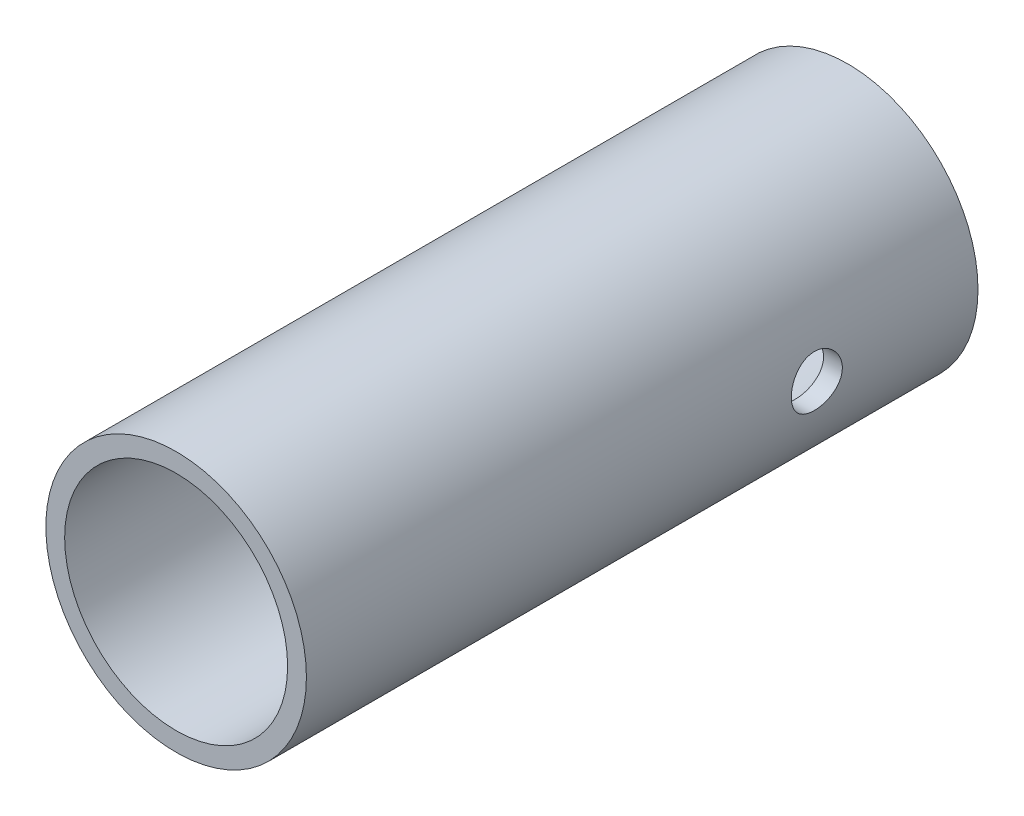
ISO-10303-21;
HEADER;
FILE_DESCRIPTION(('STEP AP214'),'2;1');
FILE_NAME('part.step','',(''),(''),'','','');
FILE_SCHEMA(('AUTOMOTIVE_DESIGN { 1 0 10303 214 1 1 1 1 }'));
ENDSEC;
DATA;
#1=APPLICATION_CONTEXT('core data for automotive mechanical design processes');
#2=APPLICATION_PROTOCOL_DEFINITION('international standard','automotive_design',2000,#1);
#3=PRODUCT_CONTEXT('',#1,'mechanical');
#4=PRODUCT('Part','Part','',(#3));
#5=PRODUCT_RELATED_PRODUCT_CATEGORY('part','',(#4));
#6=PRODUCT_DEFINITION_FORMATION('','',#4);
#7=PRODUCT_DEFINITION_CONTEXT('part definition',#1,'design');
#8=PRODUCT_DEFINITION('design','',#6,#7);
#9=PRODUCT_DEFINITION_SHAPE('','',#8);
#10=(LENGTH_UNIT() NAMED_UNIT(*) SI_UNIT(.MILLI.,.METRE.));
#11=(NAMED_UNIT(*) PLANE_ANGLE_UNIT() SI_UNIT($,.RADIAN.));
#12=(NAMED_UNIT(*) SI_UNIT($,.STERADIAN.) SOLID_ANGLE_UNIT());
#13=UNCERTAINTY_MEASURE_WITH_UNIT(LENGTH_MEASURE(1.E-05),#10,'distance_accuracy_value','');
#14=(GEOMETRIC_REPRESENTATION_CONTEXT(3) GLOBAL_UNCERTAINTY_ASSIGNED_CONTEXT((#13)) GLOBAL_UNIT_ASSIGNED_CONTEXT((#10,
#11,#12)) REPRESENTATION_CONTEXT('',''));
#15=CARTESIAN_POINT('',(0.,0.,0.));
#16=DIRECTION('',(0.,0.,1.));
#17=DIRECTION('',(1.,0.,0.));
#18=AXIS2_PLACEMENT_3D('',#15,#16,#17);
#19=CARTESIAN_POINT('',(0.,0.,25.));
#20=DIRECTION('',(0.,0.,-1.));
#21=DIRECTION('',(-1.,0.,0.));
#22=AXIS2_PLACEMENT_3D('',#19,#20,#21);
#23=CYLINDRICAL_SURFACE('',#22,4.85);
#24=CARTESIAN_POINT('',(-4.85,0.,5.05));
#25=CARTESIAN_POINT('',(-4.84999903083924,0.0528207427408081,5.05000196937121));
#26=CARTESIAN_POINT('',(-4.84912822964573,0.105666623027377,5.05442019718693));
#27=CARTESIAN_POINT('',(-4.84573840466213,0.209866186059338,5.07196323258526));
#28=CARTESIAN_POINT('',(-4.84321804398227,0.261218623152241,5.08509510228102));
#29=CARTESIAN_POINT('',(-4.83681070289238,0.360909546946135,5.11964543362747));
#30=CARTESIAN_POINT('',(-4.83292500670396,0.409250815794708,5.14105611020514));
#31=CARTESIAN_POINT('',(-4.824210045949,0.501651250568184,5.19153349478004));
#32=CARTESIAN_POINT('',(-4.81938084434004,0.545710701913675,5.22059969198999));
#33=CARTESIAN_POINT('',(-4.80924060522278,0.62887402327351,5.28596430496871));
#34=CARTESIAN_POINT('',(-4.80392460597073,0.667914119554328,5.32234309836538));
#35=CARTESIAN_POINT('',(-4.79344625935296,0.739378485234693,5.40112741723243));
#36=CARTESIAN_POINT('',(-4.78828392368136,0.771802252211187,5.44353339997394));
#37=CARTESIAN_POINT('',(-4.77864902903195,0.829382932495623,5.53362437869465));
#38=CARTESIAN_POINT('',(-4.77418285872138,0.854474201434232,5.58135207416335));
#39=CARTESIAN_POINT('',(-4.76651625404854,0.896257200966038,5.68044771127167));
#40=CARTESIAN_POINT('',(-4.76331570003591,0.912949725610517,5.7318153082562));
#41=CARTESIAN_POINT('',(-4.75859282118519,0.93725515466383,5.83604772059499));
#42=CARTESIAN_POINT('',(-4.75704987461782,0.944979726337389,5.88888554354924));
#43=CARTESIAN_POINT('',(-4.7557548043355,0.951476745499511,5.99512803252176));
#44=CARTESIAN_POINT('',(-4.7560025051227,0.950250070282137,6.04853264247808));
#45=CARTESIAN_POINT('',(-4.75824199309927,0.938969789260116,6.1535784548674));
#46=CARTESIAN_POINT('',(-4.76020855480977,0.929043845569496,6.20523398395491));
#47=CARTESIAN_POINT('',(-4.76562449613615,0.900848143139989,6.30613213703227));
#48=CARTESIAN_POINT('',(-4.76907394395024,0.882578000647468,6.35537464993101));
#49=CARTESIAN_POINT('',(-4.7770929768734,0.838089633425469,6.45041875544915));
#50=CARTESIAN_POINT('',(-4.78166970108501,0.81182048975589,6.49619588660097));
#51=CARTESIAN_POINT('',(-4.79142297617805,0.752115760040911,6.58274035188247));
#52=CARTESIAN_POINT('',(-4.79659959326066,0.71867938270875,6.62350713206999));
#53=CARTESIAN_POINT('',(-4.80707887536163,0.644904192617051,6.69961064081078));
#54=CARTESIAN_POINT('',(-4.81238217506596,0.604456341824736,6.7348416649123));
#55=CARTESIAN_POINT('',(-4.82243547139897,0.518169562088268,6.79803506850899));
#56=CARTESIAN_POINT('',(-4.82718546147511,0.47233056931268,6.82599736192939));
#57=CARTESIAN_POINT('',(-4.83560789480132,0.376447699965948,6.87387776710658));
#58=CARTESIAN_POINT('',(-4.83927876649163,0.32639782593597,6.89378416248669));
#59=CARTESIAN_POINT('',(-4.84511735851095,0.223576441811,6.92487696730025));
#60=CARTESIAN_POINT('',(-4.84728525336022,0.170805248470621,6.93606438916836));
#61=CARTESIAN_POINT('',(-4.84984943594185,0.0649479184607016,6.94925287420164));
#62=CARTESIAN_POINT('',(-4.85027362974496,0.0118804663229498,6.9513986533079));
#63=CARTESIAN_POINT('',(-4.8493799832304,-0.0938547813531432,6.94683215765911));
#64=CARTESIAN_POINT('',(-4.84806223666847,-0.146522598247449,6.94012035964191));
#65=CARTESIAN_POINT('',(-4.84385020682106,-0.249499306347915,6.91814949380826));
#66=CARTESIAN_POINT('',(-4.8409695617201,-0.299824573103678,6.90296433416511));
#67=CARTESIAN_POINT('',(-4.83395349984155,-0.39721470388934,6.86455829550828));
#68=CARTESIAN_POINT('',(-4.8298179919552,-0.444279330877012,6.84133683300505));
#69=CARTESIAN_POINT('',(-4.82068138542306,-0.53442496962058,6.78720185999841));
#70=CARTESIAN_POINT('',(-4.81567064519529,-0.577452398623696,6.75620078469319));
#71=CARTESIAN_POINT('',(-4.80536278406939,-0.65774627139636,6.68750425640485));
#72=CARTESIAN_POINT('',(-4.80006563384635,-0.695012123736601,6.64980811702167));
#73=CARTESIAN_POINT('',(-4.78968840721326,-0.763280633999259,6.56813392274997));
#74=CARTESIAN_POINT('',(-4.78461261748262,-0.794184137896305,6.52407235092258));
#75=CARTESIAN_POINT('',(-4.77534206393745,-0.848151543846252,6.43129852392472));
#76=CARTESIAN_POINT('',(-4.77114726566023,-0.871215752579222,6.38258645078145));
#77=CARTESIAN_POINT('',(-4.76414793650798,-0.908712726698105,6.28213506106267));
#78=CARTESIAN_POINT('',(-4.76133637049498,-0.923189248283483,6.23041259144157));
#79=CARTESIAN_POINT('',(-4.75740653422465,-0.943233405393607,6.12520866500382));
#80=CARTESIAN_POINT('',(-4.75628805327706,-0.94880214942153,6.07172742789749));
#81=CARTESIAN_POINT('',(-4.75588238506367,-0.950832965210094,5.96551882540325));
#82=CARTESIAN_POINT('',(-4.75656370925973,-0.947451621392281,5.91279451158233));
#83=CARTESIAN_POINT('',(-4.75961070760761,-0.932022899461825,5.80868165557292));
#84=CARTESIAN_POINT('',(-4.76197636943637,-0.919975584751645,5.7572931036145));
#85=CARTESIAN_POINT('',(-4.76811168697962,-0.887625490948483,5.6574049549024));
#86=CARTESIAN_POINT('',(-4.77187820382273,-0.867341159134214,5.60889917847277));
#87=CARTESIAN_POINT('',(-4.78039277123525,-0.819110506924346,5.51595467479358));
#88=CARTESIAN_POINT('',(-4.78514089978693,-0.791163577730771,5.47151627107358));
#89=CARTESIAN_POINT('',(-4.79518051509526,-0.727863006470876,5.38718667606625));
#90=CARTESIAN_POINT('',(-4.80047960155842,-0.692395985004618,5.34738148060475));
#91=CARTESIAN_POINT('',(-4.81096874557515,-0.615296895215185,5.27423565128147));
#92=CARTESIAN_POINT('',(-4.81615877780379,-0.573663412574319,5.24089650451166));
#93=CARTESIAN_POINT('',(-4.82590592024148,-0.484915122636675,5.18131650918356));
#94=CARTESIAN_POINT('',(-4.83045620792622,-0.437749827691263,5.1551497066266));
#95=CARTESIAN_POINT('',(-4.83834421189105,-0.339616533796544,5.11115437202579));
#96=CARTESIAN_POINT('',(-4.84168303604696,-0.288652060858103,5.09331821734623));
#97=CARTESIAN_POINT('',(-4.84611244532914,-0.197967463394652,5.07000131439655));
#98=CARTESIAN_POINT('',(-4.84756184789868,-0.158768405255598,5.06251400598928));
#99=CARTESIAN_POINT('',(-4.84950597683881,-0.079717658245463,5.05251267920694));
#100=CARTESIAN_POINT('',(-4.85000073146552,-0.0398659887258778,5.04999851363449));
#101=CARTESIAN_POINT('',(-4.85,0.,5.05));
#102=B_SPLINE_CURVE_WITH_KNOTS('',3,(#24,#25,#26,#27,#28,#29,#30,#31,#32,#33,#34,#35,#36,#37,
#38,#39,#40,#41,#42,#43,#44,#45,#46,#47,#48,#49,#50,#51,#52,#53,#54,#55,#56,#57,#58,#59,#60,#61,
#62,#63,#64,#65,#66,#67,#68,#69,#70,#71,#72,#73,#74,#75,#76,#77,#78,#79,#80,#81,#82,#83,#84,#85,
#86,#87,#88,#89,#90,#91,#92,#93,#94,#95,#96,#97,#98,#99,#100,#101),.UNSPECIFIED.,.T.,.F.,(4,2,2,
2,2,2,2,2,2,2,2,2,2,2,2,2,2,2,2,2,2,2,2,2,2,2,2,2,2,2,2,2,2,2,2,2,2,2,4),(0.,0.158316403222294,
0.316761273530738,0.475057509286654,0.63334318596582,0.793474514008009,0.953617997393803,
1.11515408669274,1.27667490084478,1.43616215402555,1.59563377638494,1.75280360996376,
1.90998067258526,2.06817996339259,2.22639672893904,2.38734054409755,2.54828626503205,
2.70946522895598,2.87062547422115,3.02919623491599,3.18775846126779,3.34495878681936,
3.50217052856555,3.66123807288888,3.82032193476559,3.98172339534944,4.14311854104033,
4.30368411706997,4.46422971041591,4.6219851550573,4.77973944553119,4.93714236763767,
5.09455779912675,5.25454092463038,5.41456080028072,5.57617529133934,5.73764161222316,
5.85713305508655,5.97662096113421),.UNSPECIFIED.);
#103=CARTESIAN_POINT('',(-4.85,0.,5.05));
#104=VERTEX_POINT('',#103);
#105=EDGE_CURVE('E77',#104,#104,#102,.T.);
#106=ORIENTED_EDGE('',*,*,#105,.T.);
#107=EDGE_LOOP('',(#106));
#108=FACE_BOUND('',#107,.T.);
#109=CARTESIAN_POINT('',(4.85,0.,5.05));
#110=CARTESIAN_POINT('',(4.84999903083924,-0.0528207427408081,5.05000196937121));
#111=CARTESIAN_POINT('',(4.84912822964573,-0.105666623027377,5.05442019718693));
#112=CARTESIAN_POINT('',(4.84573840466213,-0.209866186059338,5.07196323258526));
#113=CARTESIAN_POINT('',(4.84321804398227,-0.261218623152241,5.08509510228102));
#114=CARTESIAN_POINT('',(4.83681070289238,-0.360909546946135,5.11964543362747));
#115=CARTESIAN_POINT('',(4.83292500670396,-0.409250815794708,5.14105611020514));
#116=CARTESIAN_POINT('',(4.824210045949,-0.501651250568184,5.19153349478004));
#117=CARTESIAN_POINT('',(4.81938084434004,-0.545710701913675,5.22059969198999));
#118=CARTESIAN_POINT('',(4.80924060522278,-0.62887402327351,5.28596430496871));
#119=CARTESIAN_POINT('',(4.80392460597073,-0.667914119554328,5.32234309836538));
#120=CARTESIAN_POINT('',(4.79344625935296,-0.739378485234693,5.40112741723243));
#121=CARTESIAN_POINT('',(4.78828392368136,-0.771802252211187,5.44353339997394));
#122=CARTESIAN_POINT('',(4.77864902903195,-0.829382932495623,5.53362437869465));
#123=CARTESIAN_POINT('',(4.77418285872138,-0.854474201434232,5.58135207416335));
#124=CARTESIAN_POINT('',(4.76651625404854,-0.896257200966038,5.68044771127167));
#125=CARTESIAN_POINT('',(4.76331570003591,-0.912949725610517,5.7318153082562));
#126=CARTESIAN_POINT('',(4.75859282118519,-0.93725515466383,5.83604772059499));
#127=CARTESIAN_POINT('',(4.75704987461782,-0.944979726337389,5.88888554354924));
#128=CARTESIAN_POINT('',(4.7557548043355,-0.951476745499511,5.99512803252176));
#129=CARTESIAN_POINT('',(4.7560025051227,-0.950250070282137,6.04853264247808));
#130=CARTESIAN_POINT('',(4.75824199309927,-0.938969789260116,6.1535784548674));
#131=CARTESIAN_POINT('',(4.76020855480977,-0.929043845569496,6.20523398395491));
#132=CARTESIAN_POINT('',(4.76562449613615,-0.900848143139989,6.30613213703227));
#133=CARTESIAN_POINT('',(4.76907394395024,-0.882578000647468,6.35537464993101));
#134=CARTESIAN_POINT('',(4.7770929768734,-0.838089633425469,6.45041875544915));
#135=CARTESIAN_POINT('',(4.78166970108501,-0.81182048975589,6.49619588660097));
#136=CARTESIAN_POINT('',(4.79142297617805,-0.752115760040911,6.58274035188247));
#137=CARTESIAN_POINT('',(4.79659959326066,-0.71867938270875,6.62350713206999));
#138=CARTESIAN_POINT('',(4.80707887536163,-0.644904192617051,6.69961064081078));
#139=CARTESIAN_POINT('',(4.81238217506596,-0.604456341824736,6.7348416649123));
#140=CARTESIAN_POINT('',(4.82243547139897,-0.518169562088268,6.79803506850899));
#141=CARTESIAN_POINT('',(4.82718546147511,-0.47233056931268,6.82599736192939));
#142=CARTESIAN_POINT('',(4.83560789480132,-0.376447699965948,6.87387776710658));
#143=CARTESIAN_POINT('',(4.83927876649163,-0.32639782593597,6.89378416248669));
#144=CARTESIAN_POINT('',(4.84511735851095,-0.223576441811,6.92487696730025));
#145=CARTESIAN_POINT('',(4.84728525336022,-0.170805248470621,6.93606438916836));
#146=CARTESIAN_POINT('',(4.84984943594185,-0.0649479184607016,6.94925287420164));
#147=CARTESIAN_POINT('',(4.85027362974496,-0.0118804663229498,6.9513986533079));
#148=CARTESIAN_POINT('',(4.8493799832304,0.0938547813531432,6.94683215765911));
#149=CARTESIAN_POINT('',(4.84806223666847,0.146522598247449,6.94012035964191));
#150=CARTESIAN_POINT('',(4.84385020682106,0.249499306347915,6.91814949380826));
#151=CARTESIAN_POINT('',(4.8409695617201,0.299824573103678,6.90296433416511));
#152=CARTESIAN_POINT('',(4.83395349984155,0.39721470388934,6.86455829550828));
#153=CARTESIAN_POINT('',(4.8298179919552,0.444279330877012,6.84133683300505));
#154=CARTESIAN_POINT('',(4.82068138542306,0.53442496962058,6.78720185999841));
#155=CARTESIAN_POINT('',(4.81567064519529,0.577452398623696,6.75620078469319));
#156=CARTESIAN_POINT('',(4.80536278406939,0.65774627139636,6.68750425640485));
#157=CARTESIAN_POINT('',(4.80006563384635,0.695012123736601,6.64980811702167));
#158=CARTESIAN_POINT('',(4.78968840721326,0.763280633999259,6.56813392274997));
#159=CARTESIAN_POINT('',(4.78461261748262,0.794184137896305,6.52407235092258));
#160=CARTESIAN_POINT('',(4.77534206393745,0.848151543846252,6.43129852392472));
#161=CARTESIAN_POINT('',(4.77114726566023,0.871215752579222,6.38258645078145));
#162=CARTESIAN_POINT('',(4.76414793650798,0.908712726698105,6.28213506106267));
#163=CARTESIAN_POINT('',(4.76133637049498,0.923189248283483,6.23041259144157));
#164=CARTESIAN_POINT('',(4.75740653422465,0.943233405393607,6.12520866500382));
#165=CARTESIAN_POINT('',(4.75628805327706,0.94880214942153,6.07172742789749));
#166=CARTESIAN_POINT('',(4.75588238506367,0.950832965210094,5.96551882540325));
#167=CARTESIAN_POINT('',(4.75656370925973,0.947451621392281,5.91279451158233));
#168=CARTESIAN_POINT('',(4.75961070760761,0.932022899461825,5.80868165557292));
#169=CARTESIAN_POINT('',(4.76197636943637,0.919975584751645,5.7572931036145));
#170=CARTESIAN_POINT('',(4.76811168697962,0.887625490948483,5.6574049549024));
#171=CARTESIAN_POINT('',(4.77187820382273,0.867341159134214,5.60889917847277));
#172=CARTESIAN_POINT('',(4.78039277123525,0.819110506924346,5.51595467479358));
#173=CARTESIAN_POINT('',(4.78514089978693,0.791163577730771,5.47151627107358));
#174=CARTESIAN_POINT('',(4.79518051509526,0.727863006470876,5.38718667606625));
#175=CARTESIAN_POINT('',(4.80047960155842,0.692395985004618,5.34738148060475));
#176=CARTESIAN_POINT('',(4.81096874557515,0.615296895215185,5.27423565128147));
#177=CARTESIAN_POINT('',(4.81615877780379,0.573663412574319,5.24089650451166));
#178=CARTESIAN_POINT('',(4.82590592024148,0.484915122636675,5.18131650918356));
#179=CARTESIAN_POINT('',(4.83045620792622,0.437749827691263,5.1551497066266));
#180=CARTESIAN_POINT('',(4.83834421189105,0.339616533796544,5.11115437202579));
#181=CARTESIAN_POINT('',(4.84168303604696,0.288652060858103,5.09331821734623));
#182=CARTESIAN_POINT('',(4.84611244532914,0.197967463394652,5.07000131439655));
#183=CARTESIAN_POINT('',(4.84756184789868,0.158768405255598,5.06251400598928));
#184=CARTESIAN_POINT('',(4.84950597683881,0.079717658245463,5.05251267920694));
#185=CARTESIAN_POINT('',(4.85000073146552,0.0398659887258778,5.04999851363449));
#186=CARTESIAN_POINT('',(4.85,0.,5.05));
#187=B_SPLINE_CURVE_WITH_KNOTS('',3,(#109,#110,#111,#112,#113,#114,#115,#116,#117,#118,#119,
#120,#121,#122,#123,#124,#125,#126,#127,#128,#129,#130,#131,#132,#133,#134,#135,#136,#137,#138,
#139,#140,#141,#142,#143,#144,#145,#146,#147,#148,#149,#150,#151,#152,#153,#154,#155,#156,#157,
#158,#159,#160,#161,#162,#163,#164,#165,#166,#167,#168,#169,#170,#171,#172,#173,#174,#175,#176,
#177,#178,#179,#180,#181,#182,#183,#184,#185,#186),.UNSPECIFIED.,.T.,.F.,(4,2,2,2,2,2,2,2,2,2,2,
2,2,2,2,2,2,2,2,2,2,2,2,2,2,2,2,2,2,2,2,2,2,2,2,2,2,2,4),(0.,0.158316403222294,
0.316761273530738,0.475057509286654,0.63334318596582,0.793474514008009,0.953617997393803,
1.11515408669274,1.27667490084478,1.43616215402555,1.59563377638494,1.75280360996376,
1.90998067258526,2.06817996339259,2.22639672893904,2.38734054409755,2.54828626503205,
2.70946522895598,2.87062547422115,3.02919623491599,3.18775846126779,3.34495878681936,
3.50217052856555,3.66123807288888,3.82032193476559,3.98172339534944,4.14311854104033,
4.30368411706997,4.46422971041591,4.6219851550573,4.77973944553119,4.93714236763767,
5.09455779912675,5.25454092463038,5.41456080028072,5.57617529133934,5.73764161222316,
5.85713305508655,5.97662096113421),.UNSPECIFIED.);
#188=CARTESIAN_POINT('',(4.85,0.,5.05));
#189=VERTEX_POINT('',#188);
#190=EDGE_CURVE('E72',#189,#189,#187,.T.);
#191=ORIENTED_EDGE('',*,*,#190,.T.);
#192=EDGE_LOOP('',(#191));
#193=FACE_BOUND('',#192,.T.);
#194=CARTESIAN_POINT('',(0.,0.,25.));
#195=DIRECTION('',(0.,0.,1.));
#196=DIRECTION('',(1.,0.,0.));
#197=AXIS2_PLACEMENT_3D('',#194,#195,#196);
#198=CIRCLE('',#197,4.85);
#199=CARTESIAN_POINT('',(4.85,0.,25.));
#200=VERTEX_POINT('',#199);
#201=EDGE_CURVE('E10',#200,#200,#198,.T.);
#202=ORIENTED_EDGE('',*,*,#201,.F.);
#203=EDGE_LOOP('',(#202));
#204=FACE_BOUND('',#203,.T.);
#205=CARTESIAN_POINT('',(0.,0.,0.));
#206=DIRECTION('',(0.,0.,1.));
#207=DIRECTION('',(1.,0.,0.));
#208=AXIS2_PLACEMENT_3D('',#205,#206,#207);
#209=CIRCLE('',#208,4.85);
#210=CARTESIAN_POINT('',(4.85,0.,0.));
#211=VERTEX_POINT('',#210);
#212=EDGE_CURVE('E44',#211,#211,#209,.T.);
#213=ORIENTED_EDGE('',*,*,#212,.T.);
#214=EDGE_LOOP('',(#213));
#215=FACE_BOUND('',#214,.T.);
#216=ADVANCED_FACE('F31',(#108,#193,#204,#215),#23,.T.);
#217=CARTESIAN_POINT('',(0.,0.,25.));
#218=DIRECTION('',(0.,0.,1.));
#219=DIRECTION('',(1.,0.,0.));
#220=AXIS2_PLACEMENT_3D('',#217,#218,#219);
#221=PLANE('',#220);
#222=CARTESIAN_POINT('',(0.,0.,25.));
#223=DIRECTION('',(0.,0.,1.));
#224=DIRECTION('',(1.,0.,0.));
#225=AXIS2_PLACEMENT_3D('',#222,#223,#224);
#226=CIRCLE('',#225,4.15);
#227=CARTESIAN_POINT('',(4.15,0.,25.));
#228=VERTEX_POINT('',#227);
#229=EDGE_CURVE('E52',#228,#228,#226,.T.);
#230=ORIENTED_EDGE('',*,*,#229,.F.);
#231=EDGE_LOOP('',(#230));
#232=FACE_BOUND('',#231,.T.);
#233=ORIENTED_EDGE('',*,*,#201,.T.);
#234=EDGE_LOOP('',(#233));
#235=FACE_BOUND('',#234,.T.);
#236=ADVANCED_FACE('F89',(#232,#235),#221,.T.);
#237=CARTESIAN_POINT('',(0.,0.,0.));
#238=DIRECTION('',(0.,0.,1.));
#239=DIRECTION('',(1.,0.,0.));
#240=AXIS2_PLACEMENT_3D('',#237,#238,#239);
#241=PLANE('',#240);
#242=CARTESIAN_POINT('',(0.,0.,0.));
#243=DIRECTION('',(0.,0.,1.));
#244=DIRECTION('',(1.,0.,0.));
#245=AXIS2_PLACEMENT_3D('',#242,#243,#244);
#246=CIRCLE('',#245,4.15);
#247=CARTESIAN_POINT('',(4.15,0.,0.));
#248=VERTEX_POINT('',#247);
#249=EDGE_CURVE('E49',#248,#248,#246,.T.);
#250=ORIENTED_EDGE('',*,*,#249,.T.);
#251=EDGE_LOOP('',(#250));
#252=FACE_BOUND('',#251,.T.);
#253=ORIENTED_EDGE('',*,*,#212,.F.);
#254=EDGE_LOOP('',(#253));
#255=FACE_BOUND('',#254,.T.);
#256=ADVANCED_FACE('F91',(#252,#255),#241,.F.);
#257=CARTESIAN_POINT('',(0.,0.,0.));
#258=DIRECTION('',(0.,0.,1.));
#259=DIRECTION('',(1.,0.,0.));
#260=AXIS2_PLACEMENT_3D('',#257,#258,#259);
#261=CYLINDRICAL_SURFACE('',#260,4.15);
#262=CARTESIAN_POINT('',(4.15,0.,5.05));
#263=CARTESIAN_POINT('',(4.1499990431047,0.0526266300269672,5.05000170628251));
#264=CARTESIAN_POINT('',(4.14898884199091,0.105273363842752,5.05438774389128));
#265=CARTESIAN_POINT('',(4.14505661336488,0.20906720348093,5.07179529282467));
#266=CARTESIAN_POINT('',(4.14213330810943,0.2602132831606,5.08482257562995));
#267=CARTESIAN_POINT('',(4.13469980708857,0.35949114911916,5.11907987121897));
#268=CARTESIAN_POINT('',(4.13019134784451,0.407626166291621,5.14030091030706));
#269=CARTESIAN_POINT('',(4.12007210542072,0.499651603626272,5.1903138590752));
#270=CARTESIAN_POINT('',(4.11446132980809,0.543542052923207,5.21910571678405));
#271=CARTESIAN_POINT('',(4.10264074394695,0.626600677262044,5.28397522813313));
#272=CARTESIAN_POINT('',(4.09642292334231,0.665684059677564,5.32015999853546));
#273=CARTESIAN_POINT('',(4.08414444724267,0.737283330159248,5.39855841526884));
#274=CARTESIAN_POINT('',(4.07808380690376,0.769798586931493,5.44077264045456));
#275=CARTESIAN_POINT('',(4.06672640048456,0.827720392063375,5.53066840792679));
#276=CARTESIAN_POINT('',(4.06143987082393,0.853035243848821,5.57841044172676));
#277=CARTESIAN_POINT('',(4.05234483226091,0.895248999553901,5.67761227062808));
#278=CARTESIAN_POINT('',(4.04853612840857,0.912149013614794,5.72907157429627));
#279=CARTESIAN_POINT('',(4.04290980982978,0.936770298026267,5.83332332784539));
#280=CARTESIAN_POINT('',(4.04105950764903,0.944642444004567,5.88607834237212));
#281=CARTESIAN_POINT('',(4.03946142587473,0.951453928799262,5.99219021037871));
#282=CARTESIAN_POINT('',(4.03971336218309,0.950394474638595,6.04554698156347));
#283=CARTESIAN_POINT('',(4.042261763179,0.939493923040313,6.15021550154493));
#284=CARTESIAN_POINT('',(4.0445170984402,0.929829475287267,6.20154680184182));
#285=CARTESIAN_POINT('',(4.05075299012675,0.90227374185752,6.30183953268712));
#286=CARTESIAN_POINT('',(4.05473365156938,0.884381955394552,6.35080081877564));
#287=CARTESIAN_POINT('',(4.06401133125278,0.840720909829477,6.44545310532887));
#288=CARTESIAN_POINT('',(4.06931942547403,0.814884926115809,6.49111219620395));
#289=CARTESIAN_POINT('',(4.08064726223482,0.75611570711857,6.5775116902168));
#290=CARTESIAN_POINT('',(4.08666711041911,0.723181417643854,6.61825136135273));
#291=CARTESIAN_POINT('',(4.09891562370143,0.65022162251444,6.69467118224112));
#292=CARTESIAN_POINT('',(4.10514585222468,0.610046248401971,6.7302081518458));
#293=CARTESIAN_POINT('',(4.11698331327975,0.5242341341636,6.7940647940953));
#294=CARTESIAN_POINT('',(4.12259053233766,0.478597275965907,6.82238431066459));
#295=CARTESIAN_POINT('',(4.13257121176282,0.38297371843454,6.87104281693724));
#296=CARTESIAN_POINT('',(4.13694154801903,0.332976414477383,6.89136164827125));
#297=CARTESIAN_POINT('',(4.14393302073084,0.230154456825024,6.92326878852111));
#298=CARTESIAN_POINT('',(4.14655443638968,0.177330255879854,6.934858491021));
#299=CARTESIAN_POINT('',(4.14971247002223,0.0715808809657144,6.94876689554449));
#300=CARTESIAN_POINT('',(4.15029301873114,0.018682681532132,6.95128098727637));
#301=CARTESIAN_POINT('',(4.14942764097732,-0.0867779888507933,6.94749836514447));
#302=CARTESIAN_POINT('',(4.1479818658156,-0.139340484571995,6.94120230911451));
#303=CARTESIAN_POINT('',(4.14325415116441,-0.241980440388931,6.92013987981311));
#304=CARTESIAN_POINT('',(4.13999471818365,-0.292080323725262,6.90547727514443));
#305=CARTESIAN_POINT('',(4.13200512461609,-0.389108784790683,6.86821418578186));
#306=CARTESIAN_POINT('',(4.12727483082904,-0.436037074833515,6.84561298214934));
#307=CARTESIAN_POINT('',(4.11676071580013,-0.526188707548941,6.79271610120167));
#308=CARTESIAN_POINT('',(4.11096179380553,-0.569343874353455,6.7623073024571));
#309=CARTESIAN_POINT('',(4.09898212447264,-0.650008765436947,6.6948059875968));
#310=CARTESIAN_POINT('',(4.09280132256033,-0.687517680172095,6.65771251472318));
#311=CARTESIAN_POINT('',(4.08060072391238,-0.756608213130399,6.57699454483362));
#312=CARTESIAN_POINT('',(4.0745867492346,-0.788053930731272,6.53325267332252));
#313=CARTESIAN_POINT('',(4.06354313739658,-0.843154808244212,6.44099475414859));
#314=CARTESIAN_POINT('',(4.0585134565973,-0.866810313570048,6.39247891828466));
#315=CARTESIAN_POINT('',(4.05005866970136,-0.905492723390054,6.29231451858438));
#316=CARTESIAN_POINT('',(4.04662429775863,-0.920569572361289,6.240686064205));
#317=CARTESIAN_POINT('',(4.04173432178061,-0.941809242961782,6.13553880025276));
#318=CARTESIAN_POINT('',(4.04027836615735,-0.947973648450039,6.08202032829324));
#319=CARTESIAN_POINT('',(4.03953370833972,-0.951141111445644,5.97598618206644));
#320=CARTESIAN_POINT('',(4.04019391412747,-0.948360137936124,5.92347720508126));
#321=CARTESIAN_POINT('',(4.04349083585647,-0.934202177423752,5.81969770114546));
#322=CARTESIAN_POINT('',(4.04612752374486,-0.922825312425105,5.76842715662804));
#323=CARTESIAN_POINT('',(4.05305426648938,-0.891907272209971,5.66877120129753));
#324=CARTESIAN_POINT('',(4.05733737432128,-0.872400372706856,5.62037464128362));
#325=CARTESIAN_POINT('',(4.06707647586434,-0.825804442153874,5.52751010420672));
#326=CARTESIAN_POINT('',(4.07253260492104,-0.798714536052383,5.48304258132006));
#327=CARTESIAN_POINT('',(4.08415344299894,-0.737017558001579,5.39824018820185));
#328=CARTESIAN_POINT('',(4.09033113027351,-0.702257811184322,5.35801815238899));
#329=CARTESIAN_POINT('',(4.10261500859476,-0.626513638039077,5.28390731508705));
#330=CARTESIAN_POINT('',(4.1087211826759,-0.585527765623822,5.2500199889943));
#331=CARTESIAN_POINT('',(4.12027936117085,-0.497777542999457,5.18906675153448));
#332=CARTESIAN_POINT('',(4.1257205884969,-0.450937979054745,5.1621069487613));
#333=CARTESIAN_POINT('',(4.13522615016487,-0.353275298811623,5.11648635614116));
#334=CARTESIAN_POINT('',(4.13929158721464,-0.302455413203265,5.09781891612318));
#335=CARTESIAN_POINT('',(4.14490033282422,-0.209688075982257,5.07246897521491));
#336=CARTESIAN_POINT('',(4.14680047004259,-0.168225337997839,5.06405982894848));
#337=CARTESIAN_POINT('',(4.14935065486058,-0.0845126940065333,5.05282480358169));
#338=CARTESIAN_POINT('',(4.15000076845322,-0.0422628296736429,5.04999862973694));
#339=CARTESIAN_POINT('',(4.15,0.,5.05));
#340=B_SPLINE_CURVE_WITH_KNOTS('',3,(#262,#263,#264,#265,#266,#267,#268,#269,#270,#271,#272,
#273,#274,#275,#276,#277,#278,#279,#280,#281,#282,#283,#284,#285,#286,#287,#288,#289,#290,#291,
#292,#293,#294,#295,#296,#297,#298,#299,#300,#301,#302,#303,#304,#305,#306,#307,#308,#309,#310,
#311,#312,#313,#314,#315,#316,#317,#318,#319,#320,#321,#322,#323,#324,#325,#326,#327,#328,#329,
#330,#331,#332,#333,#334,#335,#336,#337,#338,#339),.UNSPECIFIED.,.T.,.F.,(4,2,2,2,2,2,2,2,2,2,2,
2,2,2,2,2,2,2,2,2,2,2,2,2,2,2,2,2,2,2,2,2,2,2,2,2,2,2,4),(0.,0.157725136927659,
0.315555724561111,0.473213946237564,0.630871085670011,0.790999160718817,0.951142619126144,
1.11324247754097,1.27532094499636,1.43464933209454,1.59395618778379,1.7500661998853,
1.90618571543664,2.06365408014126,2.22114584708971,2.38237887193559,2.54361538310719,
2.70525558219056,2.86686997033897,3.0249834736202,3.18308517155365,3.33926731243908,
3.49546360120354,3.65406501454949,3.81268914610763,3.97453589068014,4.13637545808971,
4.29726290146096,4.45812174949121,4.61512638401095,4.77212879015613,4.92847587449991,
5.08484100817661,5.2446562818769,5.40450873137478,5.56668054212052,5.72872206117985,
5.8553929602708,5.982057171789),.UNSPECIFIED.);
#341=CARTESIAN_POINT('',(4.15,0.,5.05));
#342=VERTEX_POINT('',#341);
#343=EDGE_CURVE('E35',#342,#342,#340,.T.);
#344=ORIENTED_EDGE('',*,*,#343,.T.);
#345=EDGE_LOOP('',(#344));
#346=FACE_BOUND('',#345,.T.);
#347=CARTESIAN_POINT('',(-4.15,0.,5.05));
#348=CARTESIAN_POINT('',(-4.1499990431047,-0.0526266300269672,5.05000170628251));
#349=CARTESIAN_POINT('',(-4.14898884199091,-0.105273363842752,5.05438774389128));
#350=CARTESIAN_POINT('',(-4.14505661336488,-0.20906720348093,5.07179529282467));
#351=CARTESIAN_POINT('',(-4.14213330810943,-0.2602132831606,5.08482257562995));
#352=CARTESIAN_POINT('',(-4.13469980708857,-0.35949114911916,5.11907987121897));
#353=CARTESIAN_POINT('',(-4.13019134784451,-0.407626166291621,5.14030091030706));
#354=CARTESIAN_POINT('',(-4.12007210542072,-0.499651603626272,5.1903138590752));
#355=CARTESIAN_POINT('',(-4.11446132980809,-0.543542052923207,5.21910571678405));
#356=CARTESIAN_POINT('',(-4.10264074394695,-0.626600677262044,5.28397522813313));
#357=CARTESIAN_POINT('',(-4.09642292334231,-0.665684059677564,5.32015999853546));
#358=CARTESIAN_POINT('',(-4.08414444724267,-0.737283330159248,5.39855841526884));
#359=CARTESIAN_POINT('',(-4.07808380690376,-0.769798586931493,5.44077264045456));
#360=CARTESIAN_POINT('',(-4.06672640048456,-0.827720392063375,5.53066840792679));
#361=CARTESIAN_POINT('',(-4.06143987082393,-0.853035243848821,5.57841044172676));
#362=CARTESIAN_POINT('',(-4.05234483226091,-0.895248999553901,5.67761227062808));
#363=CARTESIAN_POINT('',(-4.04853612840857,-0.912149013614794,5.72907157429627));
#364=CARTESIAN_POINT('',(-4.04290980982978,-0.936770298026267,5.83332332784539));
#365=CARTESIAN_POINT('',(-4.04105950764903,-0.944642444004567,5.88607834237212));
#366=CARTESIAN_POINT('',(-4.03946142587473,-0.951453928799262,5.99219021037871));
#367=CARTESIAN_POINT('',(-4.03971336218309,-0.950394474638595,6.04554698156347));
#368=CARTESIAN_POINT('',(-4.042261763179,-0.939493923040313,6.15021550154493));
#369=CARTESIAN_POINT('',(-4.0445170984402,-0.929829475287267,6.20154680184182));
#370=CARTESIAN_POINT('',(-4.05075299012675,-0.90227374185752,6.30183953268712));
#371=CARTESIAN_POINT('',(-4.05473365156938,-0.884381955394552,6.35080081877564));
#372=CARTESIAN_POINT('',(-4.06401133125278,-0.840720909829477,6.44545310532887));
#373=CARTESIAN_POINT('',(-4.06931942547403,-0.814884926115809,6.49111219620395));
#374=CARTESIAN_POINT('',(-4.08064726223482,-0.75611570711857,6.5775116902168));
#375=CARTESIAN_POINT('',(-4.08666711041911,-0.723181417643854,6.61825136135273));
#376=CARTESIAN_POINT('',(-4.09891562370143,-0.65022162251444,6.69467118224112));
#377=CARTESIAN_POINT('',(-4.10514585222468,-0.610046248401971,6.7302081518458));
#378=CARTESIAN_POINT('',(-4.11698331327975,-0.5242341341636,6.7940647940953));
#379=CARTESIAN_POINT('',(-4.12259053233766,-0.478597275965907,6.82238431066459));
#380=CARTESIAN_POINT('',(-4.13257121176282,-0.38297371843454,6.87104281693724));
#381=CARTESIAN_POINT('',(-4.13694154801903,-0.332976414477383,6.89136164827125));
#382=CARTESIAN_POINT('',(-4.14393302073084,-0.230154456825024,6.92326878852111));
#383=CARTESIAN_POINT('',(-4.14655443638968,-0.177330255879854,6.934858491021));
#384=CARTESIAN_POINT('',(-4.14971247002223,-0.0715808809657144,6.94876689554449));
#385=CARTESIAN_POINT('',(-4.15029301873114,-0.018682681532132,6.95128098727637));
#386=CARTESIAN_POINT('',(-4.14942764097732,0.0867779888507933,6.94749836514447));
#387=CARTESIAN_POINT('',(-4.1479818658156,0.139340484571995,6.94120230911451));
#388=CARTESIAN_POINT('',(-4.14325415116441,0.241980440388931,6.92013987981311));
#389=CARTESIAN_POINT('',(-4.13999471818365,0.292080323725262,6.90547727514443));
#390=CARTESIAN_POINT('',(-4.13200512461609,0.389108784790683,6.86821418578186));
#391=CARTESIAN_POINT('',(-4.12727483082904,0.436037074833515,6.84561298214934));
#392=CARTESIAN_POINT('',(-4.11676071580013,0.526188707548941,6.79271610120167));
#393=CARTESIAN_POINT('',(-4.11096179380553,0.569343874353455,6.7623073024571));
#394=CARTESIAN_POINT('',(-4.09898212447264,0.650008765436947,6.6948059875968));
#395=CARTESIAN_POINT('',(-4.09280132256033,0.687517680172095,6.65771251472318));
#396=CARTESIAN_POINT('',(-4.08060072391238,0.756608213130399,6.57699454483362));
#397=CARTESIAN_POINT('',(-4.0745867492346,0.788053930731272,6.53325267332252));
#398=CARTESIAN_POINT('',(-4.06354313739658,0.843154808244212,6.44099475414859));
#399=CARTESIAN_POINT('',(-4.0585134565973,0.866810313570048,6.39247891828466));
#400=CARTESIAN_POINT('',(-4.05005866970136,0.905492723390054,6.29231451858438));
#401=CARTESIAN_POINT('',(-4.04662429775863,0.920569572361289,6.240686064205));
#402=CARTESIAN_POINT('',(-4.04173432178061,0.941809242961782,6.13553880025276));
#403=CARTESIAN_POINT('',(-4.04027836615735,0.947973648450039,6.08202032829324));
#404=CARTESIAN_POINT('',(-4.03953370833972,0.951141111445644,5.97598618206644));
#405=CARTESIAN_POINT('',(-4.04019391412747,0.948360137936124,5.92347720508126));
#406=CARTESIAN_POINT('',(-4.04349083585647,0.934202177423752,5.81969770114546));
#407=CARTESIAN_POINT('',(-4.04612752374486,0.922825312425105,5.76842715662804));
#408=CARTESIAN_POINT('',(-4.05305426648938,0.891907272209971,5.66877120129753));
#409=CARTESIAN_POINT('',(-4.05733737432128,0.872400372706856,5.62037464128362));
#410=CARTESIAN_POINT('',(-4.06707647586434,0.825804442153874,5.52751010420672));
#411=CARTESIAN_POINT('',(-4.07253260492104,0.798714536052383,5.48304258132006));
#412=CARTESIAN_POINT('',(-4.08415344299894,0.737017558001579,5.39824018820185));
#413=CARTESIAN_POINT('',(-4.09033113027351,0.702257811184322,5.35801815238899));
#414=CARTESIAN_POINT('',(-4.10261500859476,0.626513638039077,5.28390731508705));
#415=CARTESIAN_POINT('',(-4.1087211826759,0.585527765623822,5.2500199889943));
#416=CARTESIAN_POINT('',(-4.12027936117085,0.497777542999457,5.18906675153448));
#417=CARTESIAN_POINT('',(-4.1257205884969,0.450937979054745,5.1621069487613));
#418=CARTESIAN_POINT('',(-4.13522615016487,0.353275298811623,5.11648635614116));
#419=CARTESIAN_POINT('',(-4.13929158721464,0.302455413203265,5.09781891612318));
#420=CARTESIAN_POINT('',(-4.14490033282422,0.209688075982257,5.07246897521491));
#421=CARTESIAN_POINT('',(-4.14680047004259,0.168225337997839,5.06405982894848));
#422=CARTESIAN_POINT('',(-4.14935065486058,0.0845126940065333,5.05282480358169));
#423=CARTESIAN_POINT('',(-4.15000076845322,0.0422628296736429,5.04999862973694));
#424=CARTESIAN_POINT('',(-4.15,0.,5.05));
#425=B_SPLINE_CURVE_WITH_KNOTS('',3,(#347,#348,#349,#350,#351,#352,#353,#354,#355,#356,#357,
#358,#359,#360,#361,#362,#363,#364,#365,#366,#367,#368,#369,#370,#371,#372,#373,#374,#375,#376,
#377,#378,#379,#380,#381,#382,#383,#384,#385,#386,#387,#388,#389,#390,#391,#392,#393,#394,#395,
#396,#397,#398,#399,#400,#401,#402,#403,#404,#405,#406,#407,#408,#409,#410,#411,#412,#413,#414,
#415,#416,#417,#418,#419,#420,#421,#422,#423,#424),.UNSPECIFIED.,.T.,.F.,(4,2,2,2,2,2,2,2,2,2,2,
2,2,2,2,2,2,2,2,2,2,2,2,2,2,2,2,2,2,2,2,2,2,2,2,2,2,2,4),(0.,0.157725136927659,
0.315555724561111,0.473213946237564,0.630871085670011,0.790999160718817,0.951142619126144,
1.11324247754097,1.27532094499636,1.43464933209454,1.59395618778379,1.7500661998853,
1.90618571543664,2.06365408014126,2.22114584708971,2.38237887193559,2.54361538310719,
2.70525558219056,2.86686997033897,3.0249834736202,3.18308517155365,3.33926731243908,
3.49546360120354,3.65406501454949,3.81268914610763,3.97453589068014,4.13637545808971,
4.29726290146096,4.45812174949121,4.61512638401095,4.77212879015613,4.92847587449991,
5.08484100817661,5.2446562818769,5.40450873137478,5.56668054212052,5.72872206117985,
5.8553929602708,5.982057171789),.UNSPECIFIED.);
#426=CARTESIAN_POINT('',(-4.15,0.,5.05));
#427=VERTEX_POINT('',#426);
#428=EDGE_CURVE('E54',#427,#427,#425,.T.);
#429=ORIENTED_EDGE('',*,*,#428,.T.);
#430=EDGE_LOOP('',(#429));
#431=FACE_BOUND('',#430,.T.);
#432=ORIENTED_EDGE('',*,*,#249,.F.);
#433=EDGE_LOOP('',(#432));
#434=FACE_BOUND('',#433,.T.);
#435=ORIENTED_EDGE('',*,*,#229,.T.);
#436=EDGE_LOOP('',(#435));
#437=FACE_BOUND('',#436,.T.);
#438=ADVANCED_FACE('F59',(#346,#431,#434,#437),#261,.F.);
#439=CARTESIAN_POINT('',(-4.85,0.,6.));
#440=DIRECTION('',(1.,0.,0.));
#441=DIRECTION('',(0.,0.,-1.));
#442=AXIS2_PLACEMENT_3D('',#439,#440,#441);
#443=CYLINDRICAL_SURFACE('',#442,0.949999999999999);
#444=ORIENTED_EDGE('',*,*,#428,.F.);
#445=EDGE_LOOP('',(#444));
#446=FACE_BOUND('',#445,.T.);
#447=ORIENTED_EDGE('',*,*,#105,.F.);
#448=EDGE_LOOP('',(#447));
#449=FACE_BOUND('',#448,.T.);
#450=ADVANCED_FACE('F62',(#446,#449),#443,.F.);
#451=ORIENTED_EDGE('',*,*,#343,.F.);
#452=EDGE_LOOP('',(#451));
#453=FACE_BOUND('',#452,.T.);
#454=ORIENTED_EDGE('',*,*,#190,.F.);
#455=EDGE_LOOP('',(#454));
#456=FACE_BOUND('',#455,.T.);
#457=ADVANCED_FACE('F65',(#453,#456),#443,.F.);
#458=CLOSED_SHELL('',(#216,#236,#256,#438,#450,#457));
#459=MANIFOLD_SOLID_BREP('B2',#458);
#460=ADVANCED_BREP_SHAPE_REPRESENTATION('',(#18,#459),#14);
#461=SHAPE_DEFINITION_REPRESENTATION(#9,#460);
ENDSEC;
END-ISO-10303-21;
